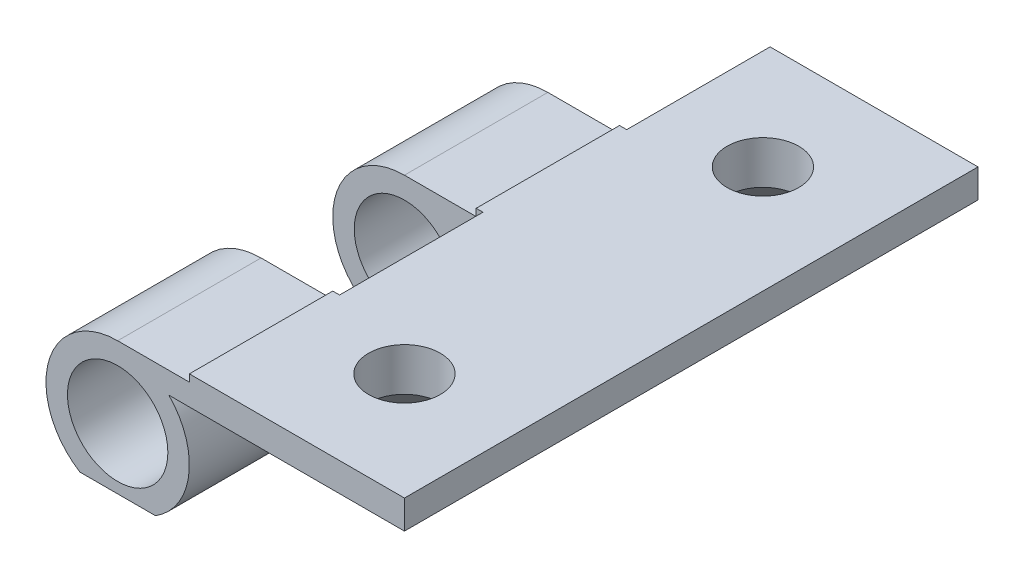
ISO-10303-21;
HEADER;
FILE_DESCRIPTION(('STEP AP214'),'2;1');
FILE_NAME('part.step','',(''),(''),'','','');
FILE_SCHEMA(('AUTOMOTIVE_DESIGN { 1 0 10303 214 1 1 1 1 }'));
ENDSEC;
DATA;
#1=APPLICATION_CONTEXT('core data for automotive mechanical design processes');
#2=APPLICATION_PROTOCOL_DEFINITION('international standard','automotive_design',2000,#1);
#3=PRODUCT_CONTEXT('',#1,'mechanical');
#4=PRODUCT('Part','Part','',(#3));
#5=PRODUCT_RELATED_PRODUCT_CATEGORY('part','',(#4));
#6=PRODUCT_DEFINITION_FORMATION('','',#4);
#7=PRODUCT_DEFINITION_CONTEXT('part definition',#1,'design');
#8=PRODUCT_DEFINITION('design','',#6,#7);
#9=PRODUCT_DEFINITION_SHAPE('','',#8);
#10=(LENGTH_UNIT() NAMED_UNIT(*) SI_UNIT(.MILLI.,.METRE.));
#11=(NAMED_UNIT(*) PLANE_ANGLE_UNIT() SI_UNIT($,.RADIAN.));
#12=(NAMED_UNIT(*) SI_UNIT($,.STERADIAN.) SOLID_ANGLE_UNIT());
#13=UNCERTAINTY_MEASURE_WITH_UNIT(LENGTH_MEASURE(1.E-05),#10,'distance_accuracy_value','');
#14=(GEOMETRIC_REPRESENTATION_CONTEXT(3) GLOBAL_UNCERTAINTY_ASSIGNED_CONTEXT((#13)) GLOBAL_UNIT_ASSIGNED_CONTEXT((#10,
#11,#12)) REPRESENTATION_CONTEXT('',''));
#15=CARTESIAN_POINT('',(0.,0.,0.));
#16=DIRECTION('',(0.,0.,1.));
#17=DIRECTION('',(1.,0.,0.));
#18=AXIS2_PLACEMENT_3D('',#15,#16,#17);
#19=CARTESIAN_POINT('',(20.,0.500000000000001,40.));
#20=DIRECTION('',(0.,1.,0.));
#21=DIRECTION('',(0.,0.,1.));
#22=AXIS2_PLACEMENT_3D('',#19,#20,#21);
#23=PLANE('',#22);
#24=DIRECTION('',(1.,0.,0.));
#25=VECTOR('',#24,1.);
#26=CARTESIAN_POINT('',(20.,0.500000000000001,3.00000000000002));
#27=LINE('',#26,#25);
#28=CARTESIAN_POINT('',(5.5,0.500000000000001,3.00000000000002));
#29=VERTEX_POINT('',#28);
#30=CARTESIAN_POINT('',(12.5,0.500000000000001,3.00000000000002));
#31=VERTEX_POINT('',#30);
#32=EDGE_CURVE('E266',#29,#31,#27,.T.);
#33=ORIENTED_EDGE('',*,*,#32,.T.);
#34=CARTESIAN_POINT('',(12.5,0.500000000000001,7.5));
#35=DIRECTION('',(0.,1.,0.));
#36=DIRECTION('',(0.,0.,1.));
#37=AXIS2_PLACEMENT_3D('',#34,#35,#36);
#38=CIRCLE('',#37,4.50000000000001);
#39=CARTESIAN_POINT('',(17.,0.500000000000001,7.5));
#40=VERTEX_POINT('',#39);
#41=EDGE_CURVE('E47',#31,#40,#38,.T.);
#42=ORIENTED_EDGE('',*,*,#41,.T.);
#43=DIRECTION('',(0.,0.,1.));
#44=VECTOR('',#43,1.);
#45=CARTESIAN_POINT('',(17.,0.500000000000001,40.));
#46=LINE('',#45,#44);
#47=CARTESIAN_POINT('',(17.,0.500000000000001,32.5));
#48=VERTEX_POINT('',#47);
#49=EDGE_CURVE('E265',#40,#48,#46,.T.);
#50=ORIENTED_EDGE('',*,*,#49,.T.);
#51=CARTESIAN_POINT('',(12.5,0.500000000000001,32.5));
#52=DIRECTION('',(0.,1.,0.));
#53=DIRECTION('',(0.,0.,1.));
#54=AXIS2_PLACEMENT_3D('',#51,#52,#53);
#55=CIRCLE('',#54,4.50000000000001);
#56=CARTESIAN_POINT('',(12.5,0.500000000000001,37.));
#57=VERTEX_POINT('',#56);
#58=EDGE_CURVE('E54',#48,#57,#55,.T.);
#59=ORIENTED_EDGE('',*,*,#58,.T.);
#60=DIRECTION('',(-1.,0.,0.));
#61=VECTOR('',#60,1.);
#62=CARTESIAN_POINT('',(4.9749371855331,0.500000000000001,37.));
#63=LINE('',#62,#61);
#64=CARTESIAN_POINT('',(4.9749371855331,0.500000000000001,37.));
#65=VERTEX_POINT('',#64);
#66=EDGE_CURVE('E256',#57,#65,#63,.T.);
#67=ORIENTED_EDGE('',*,*,#66,.T.);
#68=DIRECTION('',(0.,0.,-1.));
#69=VECTOR('',#68,1.);
#70=CARTESIAN_POINT('',(4.9749371855331,0.500000000000001,40.));
#71=LINE('',#70,#69);
#72=CARTESIAN_POINT('',(4.9749371855331,0.500000000000001,30.));
#73=VERTEX_POINT('',#72);
#74=EDGE_CURVE('E238',#65,#73,#71,.T.);
#75=ORIENTED_EDGE('',*,*,#74,.T.);
#76=DIRECTION('',(1.,0.,0.));
#77=VECTOR('',#76,1.);
#78=CARTESIAN_POINT('',(20.,0.500000000000001,30.));
#79=LINE('',#78,#77);
#80=CARTESIAN_POINT('',(5.4749371855331,0.500000000000001,30.));
#81=VERTEX_POINT('',#80);
#82=EDGE_CURVE('E379',#73,#81,#79,.T.);
#83=ORIENTED_EDGE('',*,*,#82,.T.);
#84=DIRECTION('',(0.,0.,1.));
#85=VECTOR('',#84,1.);
#86=CARTESIAN_POINT('',(5.4749371855331,0.500000000000001,30.));
#87=LINE('',#86,#85);
#88=CARTESIAN_POINT('',(5.4749371855331,0.500000000000001,20.));
#89=VERTEX_POINT('',#88);
#90=EDGE_CURVE('E428',#89,#81,#87,.T.);
#91=ORIENTED_EDGE('',*,*,#90,.F.);
#92=DIRECTION('',(-1.,0.,0.));
#93=VECTOR('',#92,1.);
#94=CARTESIAN_POINT('',(20.,0.500000000000001,20.));
#95=LINE('',#94,#93);
#96=CARTESIAN_POINT('',(4.9749371855331,0.500000000000001,20.));
#97=VERTEX_POINT('',#96);
#98=EDGE_CURVE('E367',#89,#97,#95,.T.);
#99=ORIENTED_EDGE('',*,*,#98,.T.);
#100=CARTESIAN_POINT('',(4.9749371855331,0.500000000000001,9.99999999999999));
#101=VERTEX_POINT('',#100);
#102=EDGE_CURVE('E237',#97,#101,#71,.T.);
#103=ORIENTED_EDGE('',*,*,#102,.T.);
#104=DIRECTION('',(1.,0.,0.));
#105=VECTOR('',#104,1.);
#106=CARTESIAN_POINT('',(20.,0.500000000000001,9.99999999999999));
#107=LINE('',#106,#105);
#108=CARTESIAN_POINT('',(5.5,0.500000000000001,9.99999999999999));
#109=VERTEX_POINT('',#108);
#110=EDGE_CURVE('E356',#101,#109,#107,.T.);
#111=ORIENTED_EDGE('',*,*,#110,.T.);
#112=DIRECTION('',(0.,0.,1.));
#113=VECTOR('',#112,1.);
#114=CARTESIAN_POINT('',(5.5,0.500000000000001,9.99999999999999));
#115=LINE('',#114,#113);
#116=EDGE_CURVE('E199',#29,#109,#115,.T.);
#117=ORIENTED_EDGE('',*,*,#116,.F.);
#118=EDGE_LOOP('',(#33,#42,#50,#59,#67,#75,#83,#91,#99,#103,#111,#117));
#119=FACE_BOUND('',#118,.T.);
#120=ADVANCED_FACE('F39',(#119),#23,.F.);
#121=CARTESIAN_POINT('',(17.,0.500000000000001,37.));
#122=VERTEX_POINT('',#121);
#123=EDGE_CURVE('E257',#122,#57,#63,.T.);
#124=ORIENTED_EDGE('',*,*,#123,.T.);
#125=CARTESIAN_POINT('',(12.5,0.500000000000001,32.5));
#126=DIRECTION('',(0.,1.,0.));
#127=DIRECTION('',(0.,0.,1.));
#128=AXIS2_PLACEMENT_3D('',#125,#126,#127);
#129=CIRCLE('',#128,4.50000000000001);
#130=EDGE_CURVE('E293',#57,#48,#129,.T.);
#131=ORIENTED_EDGE('',*,*,#130,.T.);
#132=EDGE_CURVE('E260',#48,#122,#46,.T.);
#133=ORIENTED_EDGE('',*,*,#132,.T.);
#134=EDGE_LOOP('',(#124,#131,#133));
#135=FACE_BOUND('',#134,.T.);
#136=ADVANCED_FACE('F327',(#135),#23,.F.);
#137=CARTESIAN_POINT('',(5.,5.5,40.));
#138=DIRECTION('',(1.,0.,0.));
#139=DIRECTION('',(0.,0.,-1.));
#140=AXIS2_PLACEMENT_3D('',#137,#138,#139);
#141=PLANE('',#140);
#142=DIRECTION('',(0.,0.,-1.));
#143=VECTOR('',#142,1.);
#144=CARTESIAN_POINT('',(5.,5.5,40.));
#145=LINE('',#144,#143);
#146=CARTESIAN_POINT('',(5.,5.5,40.));
#147=VERTEX_POINT('',#146);
#148=CARTESIAN_POINT('',(5.,5.5,30.));
#149=VERTEX_POINT('',#148);
#150=EDGE_CURVE('E233',#147,#149,#145,.T.);
#151=ORIENTED_EDGE('',*,*,#150,.T.);
#152=DIRECTION('',(0.,-1.,0.));
#153=VECTOR('',#152,1.);
#154=CARTESIAN_POINT('',(5.,5.5,30.));
#155=LINE('',#154,#153);
#156=CARTESIAN_POINT('',(5.,5.,30.));
#157=VERTEX_POINT('',#156);
#158=EDGE_CURVE('E277',#149,#157,#155,.T.);
#159=ORIENTED_EDGE('',*,*,#158,.T.);
#160=DIRECTION('',(0.,0.,-1.));
#161=VECTOR('',#160,1.);
#162=CARTESIAN_POINT('',(5.,5.,40.));
#163=LINE('',#162,#161);
#164=CARTESIAN_POINT('',(5.,5.,40.));
#165=VERTEX_POINT('',#164);
#166=EDGE_CURVE('E229',#165,#157,#163,.T.);
#167=ORIENTED_EDGE('',*,*,#166,.F.);
#168=DIRECTION('',(0.,-1.,0.));
#169=VECTOR('',#168,1.);
#170=CARTESIAN_POINT('',(5.,5.5,40.));
#171=LINE('',#170,#169);
#172=EDGE_CURVE('E391',#147,#165,#171,.T.);
#173=ORIENTED_EDGE('',*,*,#172,.F.);
#174=EDGE_LOOP('',(#151,#159,#167,#173));
#175=FACE_BOUND('',#174,.T.);
#176=ADVANCED_FACE('F487',(#175),#141,.F.);
#177=CARTESIAN_POINT('',(0.,0.,40.));
#178=DIRECTION('',(0.,0.,-1.));
#179=DIRECTION('',(-1.,0.,0.));
#180=AXIS2_PLACEMENT_3D('',#177,#178,#179);
#181=CYLINDRICAL_SURFACE('',#180,5.);
#182=CARTESIAN_POINT('',(0.,0.,30.));
#183=DIRECTION('',(0.,0.,1.));
#184=DIRECTION('',(1.,0.,0.));
#185=AXIS2_PLACEMENT_3D('',#182,#183,#184);
#186=CIRCLE('',#185,5.);
#187=CARTESIAN_POINT('',(2.63391343821319,-4.25,30.));
#188=VERTEX_POINT('',#187);
#189=EDGE_CURVE('E381',#188,#73,#186,.T.);
#190=ORIENTED_EDGE('',*,*,#189,.T.);
#191=ORIENTED_EDGE('',*,*,#74,.F.);
#192=CARTESIAN_POINT('',(0.,0.,36.5));
#193=DIRECTION('',(0.,-0.707106781186549,0.707106781186546));
#194=DIRECTION('',(0.,-0.707106781186546,-0.707106781186549));
#195=AXIS2_PLACEMENT_3D('',#192,#193,#194);
#196=ELLIPSE('',#195,7.07106781186549,5.);
#197=CARTESIAN_POINT('',(3.57071421427142,3.5,40.));
#198=VERTEX_POINT('',#197);
#199=EDGE_CURVE('E274',#65,#198,#196,.T.);
#200=ORIENTED_EDGE('',*,*,#199,.T.);
#201=CARTESIAN_POINT('',(0.,0.,40.));
#202=DIRECTION('',(0.,0.,1.));
#203=DIRECTION('',(1.,0.,0.));
#204=AXIS2_PLACEMENT_3D('',#201,#202,#203);
#205=CIRCLE('',#204,5.);
#206=CARTESIAN_POINT('',(2.63391343821319,-4.25,40.));
#207=VERTEX_POINT('',#206);
#208=EDGE_CURVE('E215',#207,#198,#205,.T.);
#209=ORIENTED_EDGE('',*,*,#208,.F.);
#210=DIRECTION('',(0.,0.,-1.));
#211=VECTOR('',#210,1.);
#212=CARTESIAN_POINT('',(2.63391343821319,-4.25,40.));
#213=LINE('',#212,#211);
#214=EDGE_CURVE('E244',#207,#188,#213,.T.);
#215=ORIENTED_EDGE('',*,*,#214,.T.);
#216=EDGE_LOOP('',(#190,#191,#200,#209,#215));
#217=FACE_BOUND('',#216,.T.);
#218=ADVANCED_FACE('F478',(#217),#181,.T.);
#219=DIRECTION('',(0.,0.,-1.));
#220=VECTOR('',#219,1.);
#221=CARTESIAN_POINT('',(0.,5.,40.));
#222=LINE('',#221,#220);
#223=CARTESIAN_POINT('',(0.,5.,40.));
#224=VERTEX_POINT('',#223);
#225=CARTESIAN_POINT('',(0.,5.,30.));
#226=VERTEX_POINT('',#225);
#227=EDGE_CURVE('E224',#224,#226,#222,.T.);
#228=ORIENTED_EDGE('',*,*,#227,.T.);
#229=CARTESIAN_POINT('',(0.,0.,30.));
#230=DIRECTION('',(0.,0.,1.));
#231=DIRECTION('',(1.,0.,0.));
#232=AXIS2_PLACEMENT_3D('',#229,#230,#231);
#233=CIRCLE('',#232,5.);
#234=CARTESIAN_POINT('',(-2.63391343821319,-4.25,30.));
#235=VERTEX_POINT('',#234);
#236=EDGE_CURVE('E377',#226,#235,#233,.T.);
#237=ORIENTED_EDGE('',*,*,#236,.T.);
#238=DIRECTION('',(0.,0.,-1.));
#239=VECTOR('',#238,1.);
#240=CARTESIAN_POINT('',(-2.63391343821319,-4.25,40.));
#241=LINE('',#240,#239);
#242=CARTESIAN_POINT('',(-2.63391343821319,-4.25,40.));
#243=VERTEX_POINT('',#242);
#244=EDGE_CURVE('E240',#235,#243,#241,.F.);
#245=ORIENTED_EDGE('',*,*,#244,.T.);
#246=EDGE_CURVE('E218',#224,#243,#205,.T.);
#247=ORIENTED_EDGE('',*,*,#246,.F.);
#248=EDGE_LOOP('',(#228,#237,#245,#247));
#249=FACE_BOUND('',#248,.T.);
#250=ADVANCED_FACE('F466',(#249),#181,.T.);
#251=CARTESIAN_POINT('',(0.,5.,40.));
#252=DIRECTION('',(0.,-1.,0.));
#253=DIRECTION('',(0.,0.,-1.));
#254=AXIS2_PLACEMENT_3D('',#251,#252,#253);
#255=PLANE('',#254);
#256=ORIENTED_EDGE('',*,*,#166,.T.);
#257=DIRECTION('',(-1.,0.,0.));
#258=VECTOR('',#257,1.);
#259=CARTESIAN_POINT('',(0.,5.,30.));
#260=LINE('',#259,#258);
#261=EDGE_CURVE('E375',#157,#226,#260,.T.);
#262=ORIENTED_EDGE('',*,*,#261,.T.);
#263=ORIENTED_EDGE('',*,*,#227,.F.);
#264=DIRECTION('',(-1.,0.,0.));
#265=VECTOR('',#264,1.);
#266=CARTESIAN_POINT('',(0.,5.,40.));
#267=LINE('',#266,#265);
#268=EDGE_CURVE('E392',#165,#224,#267,.T.);
#269=ORIENTED_EDGE('',*,*,#268,.F.);
#270=EDGE_LOOP('',(#256,#262,#263,#269));
#271=FACE_BOUND('',#270,.T.);
#272=ADVANCED_FACE('F480',(#271),#255,.F.);
#273=CARTESIAN_POINT('',(0.,0.,40.));
#274=DIRECTION('',(0.,0.,-1.));
#275=DIRECTION('',(-1.,0.,0.));
#276=AXIS2_PLACEMENT_3D('',#273,#274,#275);
#277=CYLINDRICAL_SURFACE('',#276,3.5);
#278=CARTESIAN_POINT('',(0.,0.,30.));
#279=DIRECTION('',(0.,0.,1.));
#280=DIRECTION('',(1.,0.,0.));
#281=AXIS2_PLACEMENT_3D('',#278,#279,#280);
#282=CIRCLE('',#281,3.5);
#283=CARTESIAN_POINT('',(3.5,0.,30.));
#284=VERTEX_POINT('',#283);
#285=EDGE_CURVE('E372',#284,#284,#282,.T.);
#286=ORIENTED_EDGE('',*,*,#285,.F.);
#287=EDGE_LOOP('',(#286));
#288=FACE_BOUND('',#287,.T.);
#289=CARTESIAN_POINT('',(0.,0.,40.));
#290=DIRECTION('',(0.,0.,1.));
#291=DIRECTION('',(1.,0.,0.));
#292=AXIS2_PLACEMENT_3D('',#289,#290,#291);
#293=CIRCLE('',#292,3.5);
#294=CARTESIAN_POINT('',(3.5,0.,40.));
#295=VERTEX_POINT('',#294);
#296=EDGE_CURVE('E220',#295,#295,#293,.T.);
#297=ORIENTED_EDGE('',*,*,#296,.T.);
#298=EDGE_LOOP('',(#297));
#299=FACE_BOUND('',#298,.T.);
#300=ADVANCED_FACE('F473',(#288,#299),#277,.F.);
#301=CARTESIAN_POINT('',(-6.33676251112338,-4.25,100.405530582886));
#302=DIRECTION('',(0.,1.,0.));
#303=DIRECTION('',(0.,0.,1.));
#304=AXIS2_PLACEMENT_3D('',#301,#302,#303);
#305=PLANE('',#304);
#306=ORIENTED_EDGE('',*,*,#244,.F.);
#307=DIRECTION('',(1.,0.,0.));
#308=VECTOR('',#307,1.);
#309=CARTESIAN_POINT('',(-6.33676251112338,-4.25,30.));
#310=LINE('',#309,#308);
#311=EDGE_CURVE('E250',#235,#188,#310,.T.);
#312=ORIENTED_EDGE('',*,*,#311,.T.);
#313=ORIENTED_EDGE('',*,*,#214,.F.);
#314=DIRECTION('',(-1.,0.,0.));
#315=VECTOR('',#314,1.);
#316=CARTESIAN_POINT('',(0.,-4.25,40.));
#317=LINE('',#316,#315);
#318=EDGE_CURVE('E384',#207,#243,#317,.T.);
#319=ORIENTED_EDGE('',*,*,#318,.T.);
#320=EDGE_LOOP('',(#306,#312,#313,#319));
#321=FACE_BOUND('',#320,.T.);
#322=ADVANCED_FACE('F464',(#321),#305,.F.);
#323=CARTESIAN_POINT('',(0.,0.,9.99999999999999));
#324=DIRECTION('',(0.,0.,1.));
#325=DIRECTION('',(1.,0.,0.));
#326=AXIS2_PLACEMENT_3D('',#323,#324,#325);
#327=CIRCLE('',#326,5.);
#328=CARTESIAN_POINT('',(2.63391343821319,-4.25,9.99999999999999));
#329=VERTEX_POINT('',#328);
#330=EDGE_CURVE('E358',#329,#101,#327,.T.);
#331=ORIENTED_EDGE('',*,*,#330,.T.);
#332=ORIENTED_EDGE('',*,*,#102,.F.);
#333=CARTESIAN_POINT('',(0.,0.,20.));
#334=DIRECTION('',(0.,0.,-1.));
#335=DIRECTION('',(-1.,0.,0.));
#336=AXIS2_PLACEMENT_3D('',#333,#334,#335);
#337=CIRCLE('',#336,5.);
#338=CARTESIAN_POINT('',(2.63391343821319,-4.25,20.));
#339=VERTEX_POINT('',#338);
#340=EDGE_CURVE('E370',#97,#339,#337,.T.);
#341=ORIENTED_EDGE('',*,*,#340,.T.);
#342=EDGE_CURVE('E243',#339,#329,#213,.T.);
#343=ORIENTED_EDGE('',*,*,#342,.T.);
#344=EDGE_LOOP('',(#331,#332,#341,#343));
#345=FACE_BOUND('',#344,.T.);
#346=ADVANCED_FACE('F461',(#345),#181,.T.);
#347=CARTESIAN_POINT('',(0.,0.,40.));
#348=DIRECTION('',(0.,0.,1.));
#349=DIRECTION('',(1.,0.,0.));
#350=AXIS2_PLACEMENT_3D('',#347,#348,#349);
#351=PLANE('',#350);
#352=ORIENTED_EDGE('',*,*,#208,.T.);
#353=DIRECTION('',(1.,0.,0.));
#354=VECTOR('',#353,1.);
#355=CARTESIAN_POINT('',(20.,3.5,40.));
#356=LINE('',#355,#354);
#357=CARTESIAN_POINT('',(20.,3.5,40.));
#358=VERTEX_POINT('',#357);
#359=EDGE_CURVE('E272',#198,#358,#356,.T.);
#360=ORIENTED_EDGE('',*,*,#359,.T.);
#361=DIRECTION('',(0.,1.,0.));
#362=VECTOR('',#361,1.);
#363=CARTESIAN_POINT('',(20.,5.,40.));
#364=LINE('',#363,#362);
#365=CARTESIAN_POINT('',(20.,5.5,40.));
#366=VERTEX_POINT('',#365);
#367=EDGE_CURVE('E317',#358,#366,#364,.T.);
#368=ORIENTED_EDGE('',*,*,#367,.T.);
#369=DIRECTION('',(-1.,0.,0.));
#370=VECTOR('',#369,1.);
#371=CARTESIAN_POINT('',(20.,5.5,40.));
#372=LINE('',#371,#370);
#373=EDGE_CURVE('E319',#366,#147,#372,.T.);
#374=ORIENTED_EDGE('',*,*,#373,.T.);
#375=ORIENTED_EDGE('',*,*,#172,.T.);
#376=ORIENTED_EDGE('',*,*,#268,.T.);
#377=ORIENTED_EDGE('',*,*,#246,.T.);
#378=ORIENTED_EDGE('',*,*,#318,.F.);
#379=EDGE_LOOP('',(#352,#360,#368,#374,#375,#376,#377,#378));
#380=FACE_BOUND('',#379,.T.);
#381=ORIENTED_EDGE('',*,*,#296,.F.);
#382=EDGE_LOOP('',(#381));
#383=FACE_BOUND('',#382,.T.);
#384=ADVANCED_FACE('F463',(#380,#383),#351,.T.);
#385=CARTESIAN_POINT('',(0.,0.,0.));
#386=DIRECTION('',(0.,0.,1.));
#387=DIRECTION('',(1.,0.,0.));
#388=AXIS2_PLACEMENT_3D('',#385,#386,#387);
#389=PLANE('',#388);
#390=DIRECTION('',(-1.,0.,0.));
#391=VECTOR('',#390,1.);
#392=CARTESIAN_POINT('',(0.,3.5,0.));
#393=LINE('',#392,#391);
#394=CARTESIAN_POINT('',(20.,3.5,0.));
#395=VERTEX_POINT('',#394);
#396=CARTESIAN_POINT('',(5.5,3.5,0.));
#397=VERTEX_POINT('',#396);
#398=EDGE_CURVE('E208',#395,#397,#393,.T.);
#399=ORIENTED_EDGE('',*,*,#398,.T.);
#400=DIRECTION('',(0.,-1.,0.));
#401=VECTOR('',#400,1.);
#402=CARTESIAN_POINT('',(5.5,5.5,0.));
#403=LINE('',#402,#401);
#404=CARTESIAN_POINT('',(5.5,5.5,0.));
#405=VERTEX_POINT('',#404);
#406=EDGE_CURVE('E189',#405,#397,#403,.T.);
#407=ORIENTED_EDGE('',*,*,#406,.F.);
#408=DIRECTION('',(-1.,0.,0.));
#409=VECTOR('',#408,1.);
#410=CARTESIAN_POINT('',(20.,5.5,0.));
#411=LINE('',#410,#409);
#412=CARTESIAN_POINT('',(20.,5.5,0.));
#413=VERTEX_POINT('',#412);
#414=EDGE_CURVE('E206',#413,#405,#411,.T.);
#415=ORIENTED_EDGE('',*,*,#414,.F.);
#416=DIRECTION('',(0.,1.,0.));
#417=VECTOR('',#416,1.);
#418=CARTESIAN_POINT('',(20.,5.,0.));
#419=LINE('',#418,#417);
#420=EDGE_CURVE('E216',#395,#413,#419,.T.);
#421=ORIENTED_EDGE('',*,*,#420,.F.);
#422=EDGE_LOOP('',(#399,#407,#415,#421));
#423=FACE_BOUND('',#422,.T.);
#424=ADVANCED_FACE('F204',(#423),#389,.F.);
#425=CARTESIAN_POINT('',(0.,5.,20.));
#426=VERTEX_POINT('',#425);
#427=CARTESIAN_POINT('',(0.,5.,9.99999999999999));
#428=VERTEX_POINT('',#427);
#429=EDGE_CURVE('E228',#426,#428,#222,.T.);
#430=ORIENTED_EDGE('',*,*,#429,.T.);
#431=CARTESIAN_POINT('',(0.,0.,9.99999999999999));
#432=DIRECTION('',(0.,0.,1.));
#433=DIRECTION('',(1.,0.,0.));
#434=AXIS2_PLACEMENT_3D('',#431,#432,#433);
#435=CIRCLE('',#434,5.);
#436=CARTESIAN_POINT('',(-2.63391343821319,-4.25,10.));
#437=VERTEX_POINT('',#436);
#438=EDGE_CURVE('E354',#428,#437,#435,.T.);
#439=ORIENTED_EDGE('',*,*,#438,.T.);
#440=CARTESIAN_POINT('',(-2.63391343821319,-4.25,20.));
#441=VERTEX_POINT('',#440);
#442=EDGE_CURVE('E241',#437,#441,#241,.F.);
#443=ORIENTED_EDGE('',*,*,#442,.T.);
#444=CARTESIAN_POINT('',(0.,0.,20.));
#445=DIRECTION('',(0.,0.,-1.));
#446=DIRECTION('',(-1.,0.,0.));
#447=AXIS2_PLACEMENT_3D('',#444,#445,#446);
#448=CIRCLE('',#447,5.);
#449=EDGE_CURVE('E365',#441,#426,#448,.T.);
#450=ORIENTED_EDGE('',*,*,#449,.T.);
#451=EDGE_LOOP('',(#430,#439,#443,#450));
#452=FACE_BOUND('',#451,.T.);
#453=ADVANCED_FACE('F398',(#452),#181,.T.);
#454=CARTESIAN_POINT('',(17.,0.500000000000001,3.00000000000002));
#455=VERTEX_POINT('',#454);
#456=EDGE_CURVE('E261',#455,#40,#46,.T.);
#457=ORIENTED_EDGE('',*,*,#456,.T.);
#458=CARTESIAN_POINT('',(12.5,0.500000000000001,7.5));
#459=DIRECTION('',(0.,1.,0.));
#460=DIRECTION('',(0.,0.,1.));
#461=AXIS2_PLACEMENT_3D('',#458,#459,#460);
#462=CIRCLE('',#461,4.50000000000001);
#463=EDGE_CURVE('E295',#40,#31,#462,.T.);
#464=ORIENTED_EDGE('',*,*,#463,.T.);
#465=EDGE_CURVE('E264',#31,#455,#27,.T.);
#466=ORIENTED_EDGE('',*,*,#465,.T.);
#467=EDGE_LOOP('',(#457,#464,#466));
#468=FACE_BOUND('',#467,.T.);
#469=ADVANCED_FACE('F308',(#468),#23,.F.);
#470=CARTESIAN_POINT('',(20.,5.,40.));
#471=DIRECTION('',(-1.,0.,0.));
#472=DIRECTION('',(0.,0.,1.));
#473=AXIS2_PLACEMENT_3D('',#470,#471,#472);
#474=PLANE('',#473);
#475=ORIENTED_EDGE('',*,*,#367,.F.);
#476=DIRECTION('',(0.,0.,-1.));
#477=VECTOR('',#476,1.);
#478=CARTESIAN_POINT('',(20.,3.5,40.));
#479=LINE('',#478,#477);
#480=EDGE_CURVE('E270',#358,#395,#479,.T.);
#481=ORIENTED_EDGE('',*,*,#480,.T.);
#482=ORIENTED_EDGE('',*,*,#420,.T.);
#483=DIRECTION('',(0.,0.,-1.));
#484=VECTOR('',#483,1.);
#485=CARTESIAN_POINT('',(20.,5.5,40.));
#486=LINE('',#485,#484);
#487=EDGE_CURVE('E214',#366,#413,#486,.T.);
#488=ORIENTED_EDGE('',*,*,#487,.F.);
#489=EDGE_LOOP('',(#475,#481,#482,#488));
#490=FACE_BOUND('',#489,.T.);
#491=ADVANCED_FACE('F316',(#490),#474,.F.);
#492=CARTESIAN_POINT('',(20.,5.5,40.));
#493=DIRECTION('',(0.,-1.,0.));
#494=DIRECTION('',(0.,0.,-1.));
#495=AXIS2_PLACEMENT_3D('',#492,#493,#494);
#496=PLANE('',#495);
#497=CARTESIAN_POINT('',(12.5,5.5,32.5));
#498=DIRECTION('',(0.,-1.,0.));
#499=DIRECTION('',(0.,0.,1.));
#500=AXIS2_PLACEMENT_3D('',#497,#498,#499);
#501=CIRCLE('',#500,2.5);
#502=CARTESIAN_POINT('',(12.5,5.5,35.));
#503=VERTEX_POINT('',#502);
#504=EDGE_CURVE('E285',#503,#503,#501,.T.);
#505=ORIENTED_EDGE('',*,*,#504,.T.);
#506=EDGE_LOOP('',(#505));
#507=FACE_BOUND('',#506,.T.);
#508=CARTESIAN_POINT('',(12.5,5.5,7.5));
#509=DIRECTION('',(0.,-1.,0.));
#510=DIRECTION('',(0.,0.,-1.));
#511=AXIS2_PLACEMENT_3D('',#508,#509,#510);
#512=CIRCLE('',#511,2.5);
#513=CARTESIAN_POINT('',(12.5,5.5,5.));
#514=VERTEX_POINT('',#513);
#515=EDGE_CURVE('E341',#514,#514,#512,.T.);
#516=ORIENTED_EDGE('',*,*,#515,.T.);
#517=EDGE_LOOP('',(#516));
#518=FACE_BOUND('',#517,.T.);
#519=DIRECTION('',(0.,0.,1.));
#520=VECTOR('',#519,1.);
#521=CARTESIAN_POINT('',(5.5,5.5,9.99999999999999));
#522=LINE('',#521,#520);
#523=CARTESIAN_POINT('',(5.5,5.5,9.99999999999999));
#524=VERTEX_POINT('',#523);
#525=EDGE_CURVE('E186',#405,#524,#522,.T.);
#526=ORIENTED_EDGE('',*,*,#525,.T.);
#527=DIRECTION('',(-1.,0.,0.));
#528=VECTOR('',#527,1.);
#529=CARTESIAN_POINT('',(5.,5.5,9.99999999999999));
#530=LINE('',#529,#528);
#531=CARTESIAN_POINT('',(5.,5.5,9.99999999999999));
#532=VERTEX_POINT('',#531);
#533=EDGE_CURVE('E198',#524,#532,#530,.T.);
#534=ORIENTED_EDGE('',*,*,#533,.T.);
#535=CARTESIAN_POINT('',(5.,5.5,20.));
#536=VERTEX_POINT('',#535);
#537=EDGE_CURVE('E232',#536,#532,#145,.T.);
#538=ORIENTED_EDGE('',*,*,#537,.F.);
#539=DIRECTION('',(1.,0.,0.));
#540=VECTOR('',#539,1.);
#541=CARTESIAN_POINT('',(4.9749371855331,5.5,20.));
#542=LINE('',#541,#540);
#543=CARTESIAN_POINT('',(5.4749371855331,5.5,20.));
#544=VERTEX_POINT('',#543);
#545=EDGE_CURVE('E422',#536,#544,#542,.T.);
#546=ORIENTED_EDGE('',*,*,#545,.T.);
#547=DIRECTION('',(0.,0.,1.));
#548=VECTOR('',#547,1.);
#549=CARTESIAN_POINT('',(5.4749371855331,5.5,30.));
#550=LINE('',#549,#548);
#551=CARTESIAN_POINT('',(5.4749371855331,5.5,30.));
#552=VERTEX_POINT('',#551);
#553=EDGE_CURVE('E437',#544,#552,#550,.T.);
#554=ORIENTED_EDGE('',*,*,#553,.T.);
#555=DIRECTION('',(-1.,0.,0.));
#556=VECTOR('',#555,1.);
#557=CARTESIAN_POINT('',(4.9749371855331,5.5,30.));
#558=LINE('',#557,#556);
#559=EDGE_CURVE('E440',#552,#149,#558,.T.);
#560=ORIENTED_EDGE('',*,*,#559,.T.);
#561=ORIENTED_EDGE('',*,*,#150,.F.);
#562=ORIENTED_EDGE('',*,*,#373,.F.);
#563=ORIENTED_EDGE('',*,*,#487,.T.);
#564=ORIENTED_EDGE('',*,*,#414,.T.);
#565=EDGE_LOOP('',(#526,#534,#538,#546,#554,#560,#561,#562,#563,#564));
#566=FACE_BOUND('',#565,.T.);
#567=ADVANCED_FACE('F211',(#507,#518,#566),#496,.F.);
#568=ORIENTED_EDGE('',*,*,#537,.T.);
#569=DIRECTION('',(0.,-1.,0.));
#570=VECTOR('',#569,1.);
#571=CARTESIAN_POINT('',(5.,5.5,9.99999999999999));
#572=LINE('',#571,#570);
#573=CARTESIAN_POINT('',(5.,5.,9.99999999999999));
#574=VERTEX_POINT('',#573);
#575=EDGE_CURVE('E410',#532,#574,#572,.T.);
#576=ORIENTED_EDGE('',*,*,#575,.T.);
#577=CARTESIAN_POINT('',(5.,5.,20.));
#578=VERTEX_POINT('',#577);
#579=EDGE_CURVE('E227',#578,#574,#163,.T.);
#580=ORIENTED_EDGE('',*,*,#579,.F.);
#581=DIRECTION('',(0.,1.,0.));
#582=VECTOR('',#581,1.);
#583=CARTESIAN_POINT('',(5.,5.5,20.));
#584=LINE('',#583,#582);
#585=EDGE_CURVE('E282',#578,#536,#584,.T.);
#586=ORIENTED_EDGE('',*,*,#585,.T.);
#587=EDGE_LOOP('',(#568,#576,#580,#586));
#588=FACE_BOUND('',#587,.T.);
#589=ADVANCED_FACE('F427',(#588),#141,.F.);
#590=ORIENTED_EDGE('',*,*,#579,.T.);
#591=DIRECTION('',(-1.,0.,0.));
#592=VECTOR('',#591,1.);
#593=CARTESIAN_POINT('',(0.,5.,9.99999999999999));
#594=LINE('',#593,#592);
#595=EDGE_CURVE('E351',#574,#428,#594,.T.);
#596=ORIENTED_EDGE('',*,*,#595,.T.);
#597=ORIENTED_EDGE('',*,*,#429,.F.);
#598=DIRECTION('',(1.,0.,0.));
#599=VECTOR('',#598,1.);
#600=CARTESIAN_POINT('',(0.,5.,20.));
#601=LINE('',#600,#599);
#602=EDGE_CURVE('E363',#426,#578,#601,.T.);
#603=ORIENTED_EDGE('',*,*,#602,.T.);
#604=EDGE_LOOP('',(#590,#596,#597,#603));
#605=FACE_BOUND('',#604,.T.);
#606=ADVANCED_FACE('F404',(#605),#255,.F.);
#607=CARTESIAN_POINT('',(0.,0.,9.99999999999999));
#608=DIRECTION('',(0.,0.,1.));
#609=DIRECTION('',(1.,0.,0.));
#610=AXIS2_PLACEMENT_3D('',#607,#608,#609);
#611=CIRCLE('',#610,3.5);
#612=CARTESIAN_POINT('',(3.5,0.,9.99999999999999));
#613=VERTEX_POINT('',#612);
#614=EDGE_CURVE('E344',#613,#613,#611,.T.);
#615=ORIENTED_EDGE('',*,*,#614,.F.);
#616=EDGE_LOOP('',(#615));
#617=FACE_BOUND('',#616,.T.);
#618=CARTESIAN_POINT('',(0.,0.,20.));
#619=DIRECTION('',(0.,0.,-1.));
#620=DIRECTION('',(-1.,0.,0.));
#621=AXIS2_PLACEMENT_3D('',#618,#619,#620);
#622=CIRCLE('',#621,3.5);
#623=CARTESIAN_POINT('',(-3.5,0.,20.));
#624=VERTEX_POINT('',#623);
#625=EDGE_CURVE('E360',#624,#624,#622,.T.);
#626=ORIENTED_EDGE('',*,*,#625,.F.);
#627=EDGE_LOOP('',(#626));
#628=FACE_BOUND('',#627,.T.);
#629=ADVANCED_FACE('F504',(#617,#628),#277,.F.);
#630=ORIENTED_EDGE('',*,*,#442,.F.);
#631=DIRECTION('',(1.,0.,0.));
#632=VECTOR('',#631,1.);
#633=CARTESIAN_POINT('',(-6.33676251112338,-4.25,9.99999999999999));
#634=LINE('',#633,#632);
#635=EDGE_CURVE('E253',#437,#329,#634,.T.);
#636=ORIENTED_EDGE('',*,*,#635,.T.);
#637=ORIENTED_EDGE('',*,*,#342,.F.);
#638=DIRECTION('',(-1.,0.,0.));
#639=VECTOR('',#638,1.);
#640=CARTESIAN_POINT('',(-6.33676251112333,-4.25,20.));
#641=LINE('',#640,#639);
#642=EDGE_CURVE('E247',#339,#441,#641,.T.);
#643=ORIENTED_EDGE('',*,*,#642,.T.);
#644=EDGE_LOOP('',(#630,#636,#637,#643));
#645=FACE_BOUND('',#644,.T.);
#646=ADVANCED_FACE('F416',(#645),#305,.F.);
#647=CARTESIAN_POINT('',(-5.,5.5,30.));
#648=DIRECTION('',(0.,0.,1.));
#649=DIRECTION('',(1.,0.,0.));
#650=AXIS2_PLACEMENT_3D('',#647,#648,#649);
#651=PLANE('',#650);
#652=ORIENTED_EDGE('',*,*,#285,.T.);
#653=EDGE_LOOP('',(#652));
#654=FACE_BOUND('',#653,.T.);
#655=ORIENTED_EDGE('',*,*,#236,.F.);
#656=ORIENTED_EDGE('',*,*,#261,.F.);
#657=ORIENTED_EDGE('',*,*,#158,.F.);
#658=ORIENTED_EDGE('',*,*,#559,.F.);
#659=DIRECTION('',(0.,-1.,0.));
#660=VECTOR('',#659,1.);
#661=CARTESIAN_POINT('',(5.4749371855331,5.5,30.));
#662=LINE('',#661,#660);
#663=EDGE_CURVE('E426',#552,#81,#662,.T.);
#664=ORIENTED_EDGE('',*,*,#663,.T.);
#665=ORIENTED_EDGE('',*,*,#82,.F.);
#666=ORIENTED_EDGE('',*,*,#189,.F.);
#667=ORIENTED_EDGE('',*,*,#311,.F.);
#668=EDGE_LOOP('',(#655,#656,#657,#658,#664,#665,#666,#667));
#669=FACE_BOUND('',#668,.T.);
#670=ADVANCED_FACE('F457',(#654,#669),#651,.F.);
#671=CARTESIAN_POINT('',(-4.99999999999999,5.5,20.));
#672=DIRECTION('',(0.,0.,-1.));
#673=DIRECTION('',(-1.,0.,0.));
#674=AXIS2_PLACEMENT_3D('',#671,#672,#673);
#675=PLANE('',#674);
#676=ORIENTED_EDGE('',*,*,#625,.T.);
#677=EDGE_LOOP('',(#676));
#678=FACE_BOUND('',#677,.T.);
#679=ORIENTED_EDGE('',*,*,#340,.F.);
#680=ORIENTED_EDGE('',*,*,#98,.F.);
#681=DIRECTION('',(0.,-1.,0.));
#682=VECTOR('',#681,1.);
#683=CARTESIAN_POINT('',(5.4749371855331,5.5,20.));
#684=LINE('',#683,#682);
#685=EDGE_CURVE('E442',#544,#89,#684,.T.);
#686=ORIENTED_EDGE('',*,*,#685,.F.);
#687=ORIENTED_EDGE('',*,*,#545,.F.);
#688=ORIENTED_EDGE('',*,*,#585,.F.);
#689=ORIENTED_EDGE('',*,*,#602,.F.);
#690=ORIENTED_EDGE('',*,*,#449,.F.);
#691=ORIENTED_EDGE('',*,*,#642,.F.);
#692=EDGE_LOOP('',(#679,#680,#686,#687,#688,#689,#690,#691));
#693=FACE_BOUND('',#692,.T.);
#694=ADVANCED_FACE('F419',(#678,#693),#675,.F.);
#695=CARTESIAN_POINT('',(5.,5.5,10.));
#696=DIRECTION('',(0.,0.,1.));
#697=DIRECTION('',(1.,0.,0.));
#698=AXIS2_PLACEMENT_3D('',#695,#696,#697);
#699=PLANE('',#698);
#700=ORIENTED_EDGE('',*,*,#614,.T.);
#701=EDGE_LOOP('',(#700));
#702=FACE_BOUND('',#701,.T.);
#703=ORIENTED_EDGE('',*,*,#635,.F.);
#704=ORIENTED_EDGE('',*,*,#438,.F.);
#705=ORIENTED_EDGE('',*,*,#595,.F.);
#706=ORIENTED_EDGE('',*,*,#575,.F.);
#707=ORIENTED_EDGE('',*,*,#533,.F.);
#708=DIRECTION('',(0.,-1.,0.));
#709=VECTOR('',#708,1.);
#710=CARTESIAN_POINT('',(5.5,5.5,9.99999999999999));
#711=LINE('',#710,#709);
#712=EDGE_CURVE('E193',#524,#109,#711,.T.);
#713=ORIENTED_EDGE('',*,*,#712,.T.);
#714=ORIENTED_EDGE('',*,*,#110,.F.);
#715=ORIENTED_EDGE('',*,*,#330,.F.);
#716=EDGE_LOOP('',(#703,#704,#705,#706,#707,#713,#714,#715));
#717=FACE_BOUND('',#716,.T.);
#718=ADVANCED_FACE('F409',(#702,#717),#699,.F.);
#719=CARTESIAN_POINT('',(12.5,5.5,7.5));
#720=DIRECTION('',(0.,-1.,0.));
#721=DIRECTION('',(0.,0.,-1.));
#722=AXIS2_PLACEMENT_3D('',#719,#720,#721);
#723=CYLINDRICAL_SURFACE('',#722,2.5);
#724=CARTESIAN_POINT('',(12.5,2.50000000000001,7.5));
#725=DIRECTION('',(0.,1.,0.));
#726=DIRECTION('',(0.,0.,1.));
#727=AXIS2_PLACEMENT_3D('',#724,#725,#726);
#728=CIRCLE('',#727,2.5);
#729=CARTESIAN_POINT('',(12.5,2.50000000000001,10.));
#730=VERTEX_POINT('',#729);
#731=EDGE_CURVE('E289',#730,#730,#728,.F.);
#732=ORIENTED_EDGE('',*,*,#731,.T.);
#733=EDGE_LOOP('',(#732));
#734=FACE_BOUND('',#733,.T.);
#735=ORIENTED_EDGE('',*,*,#515,.F.);
#736=EDGE_LOOP('',(#735));
#737=FACE_BOUND('',#736,.T.);
#738=ADVANCED_FACE('F336',(#734,#737),#723,.F.);
#739=CARTESIAN_POINT('',(12.5,5.5,32.5));
#740=DIRECTION('',(0.,-1.,0.));
#741=DIRECTION('',(0.,0.,-1.));
#742=AXIS2_PLACEMENT_3D('',#739,#740,#741);
#743=CYLINDRICAL_SURFACE('',#742,2.5);
#744=CARTESIAN_POINT('',(12.5,2.50000000000001,32.5));
#745=DIRECTION('',(0.,1.,0.));
#746=DIRECTION('',(0.,0.,1.));
#747=AXIS2_PLACEMENT_3D('',#744,#745,#746);
#748=CIRCLE('',#747,2.5);
#749=CARTESIAN_POINT('',(12.5,2.50000000000001,35.));
#750=VERTEX_POINT('',#749);
#751=EDGE_CURVE('E11',#750,#750,#748,.F.);
#752=ORIENTED_EDGE('',*,*,#751,.T.);
#753=EDGE_LOOP('',(#752));
#754=FACE_BOUND('',#753,.T.);
#755=ORIENTED_EDGE('',*,*,#504,.F.);
#756=EDGE_LOOP('',(#755));
#757=FACE_BOUND('',#756,.T.);
#758=ADVANCED_FACE('F333',(#754,#757),#743,.F.);
#759=CARTESIAN_POINT('',(0.,3.5,40.));
#760=DIRECTION('',(0.,-0.707106781186549,0.707106781186546));
#761=DIRECTION('',(-1.,0.,0.));
#762=AXIS2_PLACEMENT_3D('',#759,#760,#761);
#763=PLANE('',#762);
#764=ORIENTED_EDGE('',*,*,#199,.F.);
#765=ORIENTED_EDGE('',*,*,#66,.F.);
#766=ORIENTED_EDGE('',*,*,#123,.F.);
#767=DIRECTION('',(-0.577350269189627,-0.577350269189624,-0.577350269189627));
#768=VECTOR('',#767,1.);
#769=CARTESIAN_POINT('',(13.3333333333333,-3.16666666666665,33.3333333333333));
#770=LINE('',#769,#768);
#771=EDGE_CURVE('E281',#358,#122,#770,.T.);
#772=ORIENTED_EDGE('',*,*,#771,.F.);
#773=ORIENTED_EDGE('',*,*,#359,.F.);
#774=EDGE_LOOP('',(#764,#765,#766,#772,#773));
#775=FACE_BOUND('',#774,.T.);
#776=ADVANCED_FACE('F325',(#775),#763,.T.);
#777=CARTESIAN_POINT('',(20.,3.5,40.));
#778=DIRECTION('',(-0.707106781186546,0.707106781186549,0.));
#779=DIRECTION('',(0.,0.,-1.));
#780=AXIS2_PLACEMENT_3D('',#777,#778,#779);
#781=PLANE('',#780);
#782=ORIENTED_EDGE('',*,*,#771,.T.);
#783=ORIENTED_EDGE('',*,*,#132,.F.);
#784=ORIENTED_EDGE('',*,*,#49,.F.);
#785=ORIENTED_EDGE('',*,*,#456,.F.);
#786=DIRECTION('',(0.577350269189627,0.577350269189624,-0.577350269189627));
#787=VECTOR('',#786,1.);
#788=CARTESIAN_POINT('',(6.66666666666663,-9.83333333333331,13.3333333333334));
#789=LINE('',#788,#787);
#790=EDGE_CURVE('E278',#395,#455,#789,.F.);
#791=ORIENTED_EDGE('',*,*,#790,.F.);
#792=ORIENTED_EDGE('',*,*,#480,.F.);
#793=EDGE_LOOP('',(#782,#783,#784,#785,#791,#792));
#794=FACE_BOUND('',#793,.T.);
#795=ADVANCED_FACE('F305',(#794),#781,.F.);
#796=CARTESIAN_POINT('',(20.,0.500000000000001,3.00000000000002));
#797=DIRECTION('',(0.,0.707106781186549,0.707106781186546));
#798=DIRECTION('',(1.,0.,0.));
#799=AXIS2_PLACEMENT_3D('',#796,#797,#798);
#800=PLANE('',#799);
#801=DIRECTION('',(0.,0.707106781186546,-0.707106781186549));
#802=VECTOR('',#801,1.);
#803=CARTESIAN_POINT('',(5.5,0.500000000000002,3.00000000000002));
#804=LINE('',#803,#802);
#805=EDGE_CURVE('E287',#397,#29,#804,.F.);
#806=ORIENTED_EDGE('',*,*,#805,.F.);
#807=ORIENTED_EDGE('',*,*,#398,.F.);
#808=ORIENTED_EDGE('',*,*,#790,.T.);
#809=ORIENTED_EDGE('',*,*,#465,.F.);
#810=ORIENTED_EDGE('',*,*,#32,.F.);
#811=EDGE_LOOP('',(#806,#807,#808,#809,#810));
#812=FACE_BOUND('',#811,.T.);
#813=ADVANCED_FACE('F311',(#812),#800,.F.);
#814=CARTESIAN_POINT('',(5.4749371855331,5.5,30.));
#815=DIRECTION('',(1.,0.,0.));
#816=DIRECTION('',(0.,0.,-1.));
#817=AXIS2_PLACEMENT_3D('',#814,#815,#816);
#818=PLANE('',#817);
#819=ORIENTED_EDGE('',*,*,#90,.T.);
#820=ORIENTED_EDGE('',*,*,#663,.F.);
#821=ORIENTED_EDGE('',*,*,#553,.F.);
#822=ORIENTED_EDGE('',*,*,#685,.T.);
#823=EDGE_LOOP('',(#819,#820,#821,#822));
#824=FACE_BOUND('',#823,.T.);
#825=ADVANCED_FACE('F449',(#824),#818,.F.);
#826=CARTESIAN_POINT('',(5.5,5.5,9.99999999999999));
#827=DIRECTION('',(1.,0.,0.));
#828=DIRECTION('',(0.,0.,-1.));
#829=AXIS2_PLACEMENT_3D('',#826,#827,#828);
#830=PLANE('',#829);
#831=ORIENTED_EDGE('',*,*,#805,.T.);
#832=ORIENTED_EDGE('',*,*,#116,.T.);
#833=ORIENTED_EDGE('',*,*,#712,.F.);
#834=ORIENTED_EDGE('',*,*,#525,.F.);
#835=ORIENTED_EDGE('',*,*,#406,.T.);
#836=EDGE_LOOP('',(#831,#832,#833,#834,#835));
#837=FACE_BOUND('',#836,.T.);
#838=ADVANCED_FACE('F188',(#837),#830,.F.);
#839=CARTESIAN_POINT('',(12.5,2.50000000000001,7.5));
#840=DIRECTION('',(0.,-1.,0.));
#841=DIRECTION('',(0.,0.,-1.));
#842=AXIS2_PLACEMENT_3D('',#839,#840,#841);
#843=CONICAL_SURFACE('',#842,2.5,0.78539816339745);
#844=ORIENTED_EDGE('',*,*,#463,.F.);
#845=ORIENTED_EDGE('',*,*,#41,.F.);
#846=EDGE_LOOP('',(#844,#845));
#847=FACE_BOUND('',#846,.T.);
#848=ORIENTED_EDGE('',*,*,#731,.F.);
#849=EDGE_LOOP('',(#848));
#850=FACE_BOUND('',#849,.T.);
#851=ADVANCED_FACE('F330',(#847,#850),#843,.F.);
#852=CARTESIAN_POINT('',(12.5,2.50000000000001,32.5));
#853=DIRECTION('',(0.,-1.,0.));
#854=DIRECTION('',(0.,0.,-1.));
#855=AXIS2_PLACEMENT_3D('',#852,#853,#854);
#856=CONICAL_SURFACE('',#855,2.5,0.78539816339745);
#857=ORIENTED_EDGE('',*,*,#58,.F.);
#858=ORIENTED_EDGE('',*,*,#130,.F.);
#859=EDGE_LOOP('',(#857,#858));
#860=FACE_BOUND('',#859,.T.);
#861=ORIENTED_EDGE('',*,*,#751,.F.);
#862=EDGE_LOOP('',(#861));
#863=FACE_BOUND('',#862,.T.);
#864=ADVANCED_FACE('F41',(#860,#863),#856,.F.);
#865=CLOSED_SHELL('',(#120,#136,#176,#218,#250,#272,#300,#322,#346,#384,#424,#453,#469,#491,
#567,#589,#606,#629,#646,#670,#694,#718,#738,#758,#776,#795,#813,#825,#838,#851,#864));
#866=MANIFOLD_SOLID_BREP('B2',#865);
#867=ADVANCED_BREP_SHAPE_REPRESENTATION('',(#18,#866),#14);
#868=SHAPE_DEFINITION_REPRESENTATION(#9,#867);
ENDSEC;
END-ISO-10303-21;
